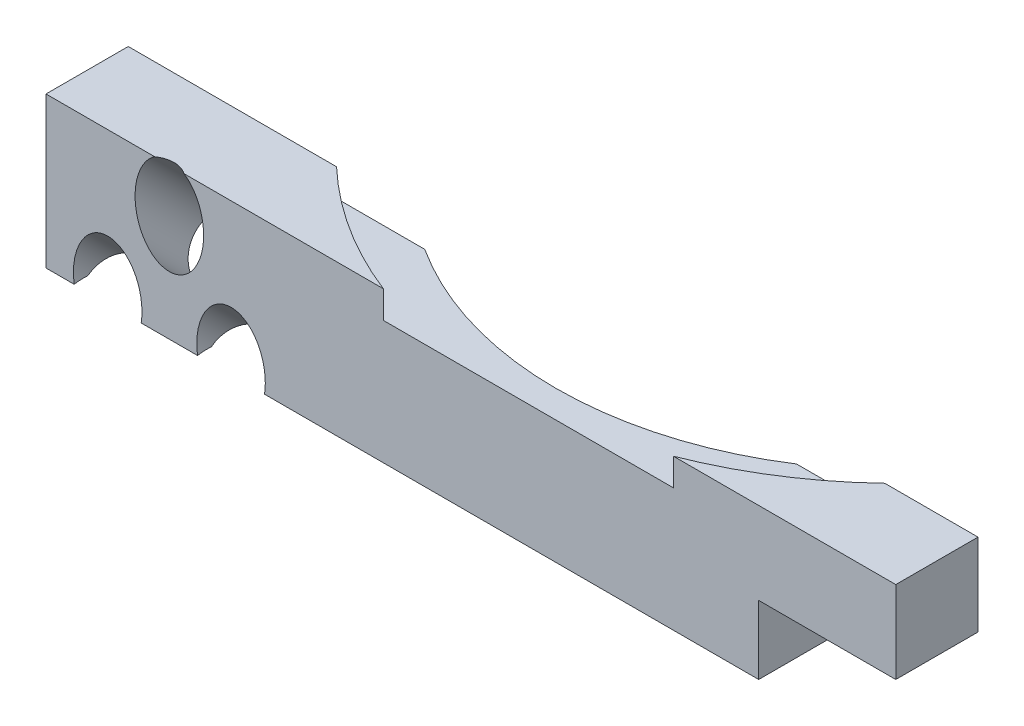
ISO-10303-21;
HEADER;
FILE_DESCRIPTION(('STEP AP214'),'2;1');
FILE_NAME('part.step','',(''),(''),'','','');
FILE_SCHEMA(('AUTOMOTIVE_DESIGN { 1 0 10303 214 1 1 1 1 }'));
ENDSEC;
DATA;
#1=APPLICATION_CONTEXT('core data for automotive mechanical design processes');
#2=APPLICATION_PROTOCOL_DEFINITION('international standard','automotive_design',2000,#1);
#3=PRODUCT_CONTEXT('',#1,'mechanical');
#4=PRODUCT('Part','Part','',(#3));
#5=PRODUCT_RELATED_PRODUCT_CATEGORY('part','',(#4));
#6=PRODUCT_DEFINITION_FORMATION('','',#4);
#7=PRODUCT_DEFINITION_CONTEXT('part definition',#1,'design');
#8=PRODUCT_DEFINITION('design','',#6,#7);
#9=PRODUCT_DEFINITION_SHAPE('','',#8);
#10=(LENGTH_UNIT() NAMED_UNIT(*) SI_UNIT(.MILLI.,.METRE.));
#11=(NAMED_UNIT(*) PLANE_ANGLE_UNIT() SI_UNIT($,.RADIAN.));
#12=(NAMED_UNIT(*) SI_UNIT($,.STERADIAN.) SOLID_ANGLE_UNIT());
#13=UNCERTAINTY_MEASURE_WITH_UNIT(LENGTH_MEASURE(1.E-05),#10,'distance_accuracy_value','');
#14=(GEOMETRIC_REPRESENTATION_CONTEXT(3) GLOBAL_UNCERTAINTY_ASSIGNED_CONTEXT((#13)) GLOBAL_UNIT_ASSIGNED_CONTEXT((#10,
#11,#12)) REPRESENTATION_CONTEXT('',''));
#15=CARTESIAN_POINT('',(0.,0.,0.));
#16=DIRECTION('',(0.,0.,1.));
#17=DIRECTION('',(1.,0.,0.));
#18=AXIS2_PLACEMENT_3D('',#15,#16,#17);
#19=CARTESIAN_POINT('',(-35.2,-5.5,6.));
#20=DIRECTION('',(0.,1.,0.));
#21=DIRECTION('',(0.,0.,1.));
#22=AXIS2_PLACEMENT_3D('',#19,#20,#21);
#23=PLANE('',#22);
#24=DIRECTION('',(-1.,0.,0.));
#25=VECTOR('',#24,1.);
#26=CARTESIAN_POINT('',(-18.2,-5.5,4.94974746830584));
#27=LINE('',#26,#25);
#28=CARTESIAN_POINT('',(-24.1901392508919,-5.5,4.94974746830584));
#29=VERTEX_POINT('',#28);
#30=CARTESIAN_POINT('',(-28.2098607491081,-5.5,4.94974746830584));
#31=VERTEX_POINT('',#30);
#32=EDGE_CURVE('E187',#29,#31,#27,.T.);
#33=ORIENTED_EDGE('',*,*,#32,.F.);
#34=CARTESIAN_POINT('',(-21.7,-5.5,5.26345596729061));
#35=DIRECTION('',(0.,1.,0.));
#36=DIRECTION('',(0.,0.,-1.));
#37=AXIS2_PLACEMENT_3D('',#34,#35,#36);
#38=ELLIPSE('',#37,3.53553390593273,2.5);
#39=CARTESIAN_POINT('',(-24.1451485525301,-5.5,6.));
#40=VERTEX_POINT('',#39);
#41=EDGE_CURVE('E45',#29,#40,#38,.T.);
#42=ORIENTED_EDGE('',*,*,#41,.T.);
#43=DIRECTION('',(1.,0.,0.));
#44=VECTOR('',#43,1.);
#45=CARTESIAN_POINT('',(-35.2,-5.5,6.));
#46=LINE('',#45,#44);
#47=CARTESIAN_POINT('',(-28.2548514474699,-5.5,6.));
#48=VERTEX_POINT('',#47);
#49=EDGE_CURVE('E223',#48,#40,#46,.T.);
#50=ORIENTED_EDGE('',*,*,#49,.F.);
#51=CARTESIAN_POINT('',(-30.7,-5.5,5.26345596729061));
#52=DIRECTION('',(0.,1.,0.));
#53=DIRECTION('',(0.,0.,-1.));
#54=AXIS2_PLACEMENT_3D('',#51,#52,#53);
#55=ELLIPSE('',#54,3.53553390593273,2.5);
#56=EDGE_CURVE('E238',#48,#31,#55,.T.);
#57=ORIENTED_EDGE('',*,*,#56,.T.);
#58=EDGE_LOOP('',(#33,#42,#50,#57));
#59=FACE_BOUND('',#58,.T.);
#60=ADVANCED_FACE('F31',(#59),#23,.F.);
#61=CARTESIAN_POINT('',(-33.1901392508919,-5.5,4.94974746830584));
#62=VERTEX_POINT('',#61);
#63=CARTESIAN_POINT('',(-35.2,-5.5,4.94974746830584));
#64=VERTEX_POINT('',#63);
#65=EDGE_CURVE('E189',#62,#64,#27,.T.);
#66=ORIENTED_EDGE('',*,*,#65,.F.);
#67=CARTESIAN_POINT('',(-33.1451485525301,-5.5,6.));
#68=VERTEX_POINT('',#67);
#69=EDGE_CURVE('E53',#62,#68,#55,.T.);
#70=ORIENTED_EDGE('',*,*,#69,.T.);
#71=CARTESIAN_POINT('',(-35.2,-5.5,6.));
#72=VERTEX_POINT('',#71);
#73=EDGE_CURVE('E219',#72,#68,#46,.T.);
#74=ORIENTED_EDGE('',*,*,#73,.F.);
#75=DIRECTION('',(0.,0.,-1.));
#76=VECTOR('',#75,1.);
#77=CARTESIAN_POINT('',(-35.2,-5.5,6.));
#78=LINE('',#77,#76);
#79=EDGE_CURVE('E222',#72,#64,#78,.T.);
#80=ORIENTED_EDGE('',*,*,#79,.T.);
#81=EDGE_LOOP('',(#66,#70,#74,#80));
#82=FACE_BOUND('',#81,.T.);
#83=ADVANCED_FACE('F324',(#82),#23,.F.);
#84=CARTESIAN_POINT('',(-19.2548514474699,-5.5,6.));
#85=VERTEX_POINT('',#84);
#86=CARTESIAN_POINT('',(16.8,-5.5,6.));
#87=VERTEX_POINT('',#86);
#88=EDGE_CURVE('E179',#85,#87,#46,.T.);
#89=ORIENTED_EDGE('',*,*,#88,.F.);
#90=CARTESIAN_POINT('',(-19.2098607491081,-5.5,4.94974746830584));
#91=VERTEX_POINT('',#90);
#92=EDGE_CURVE('E167',#85,#91,#38,.T.);
#93=ORIENTED_EDGE('',*,*,#92,.T.);
#94=CARTESIAN_POINT('',(-18.2,-5.5,4.94974746830584));
#95=VERTEX_POINT('',#94);
#96=EDGE_CURVE('E177',#95,#91,#27,.T.);
#97=ORIENTED_EDGE('',*,*,#96,.F.);
#98=DIRECTION('',(0.,0.,1.));
#99=VECTOR('',#98,1.);
#100=CARTESIAN_POINT('',(-18.2,-5.5,3.));
#101=LINE('',#100,#99);
#102=CARTESIAN_POINT('',(-18.2,-5.5,0.));
#103=VERTEX_POINT('',#102);
#104=EDGE_CURVE('E203',#103,#95,#101,.T.);
#105=ORIENTED_EDGE('',*,*,#104,.F.);
#106=DIRECTION('',(1.,0.,0.));
#107=VECTOR('',#106,1.);
#108=CARTESIAN_POINT('',(-35.2,-5.5,0.));
#109=LINE('',#108,#107);
#110=CARTESIAN_POINT('',(16.8,-5.5,0.));
#111=VERTEX_POINT('',#110);
#112=EDGE_CURVE('E229',#103,#111,#109,.T.);
#113=ORIENTED_EDGE('',*,*,#112,.T.);
#114=DIRECTION('',(0.,0.,-1.));
#115=VECTOR('',#114,1.);
#116=CARTESIAN_POINT('',(16.8,-5.5,6.));
#117=LINE('',#116,#115);
#118=EDGE_CURVE('E261',#87,#111,#117,.T.);
#119=ORIENTED_EDGE('',*,*,#118,.F.);
#120=EDGE_LOOP('',(#89,#93,#97,#105,#113,#119));
#121=FACE_BOUND('',#120,.T.);
#122=ADVANCED_FACE('F175',(#121),#23,.F.);
#123=CARTESIAN_POINT('',(35.2,5.5,0.));
#124=DIRECTION('',(0.,0.,-1.));
#125=DIRECTION('',(-1.,0.,0.));
#126=AXIS2_PLACEMENT_3D('',#123,#124,#125);
#127=PLANE('',#126);
#128=CARTESIAN_POINT('',(-26.2,-3.69238815542514,0.));
#129=DIRECTION('',(0.,0.,-1.));
#130=DIRECTION('',(0.,-1.,0.));
#131=AXIS2_PLACEMENT_3D('',#128,#129,#130);
#132=ELLIPSE('',#131,3.53553390593274,2.5);
#133=CARTESIAN_POINT('',(-27.3460767256342,-0.550252531694176,0.));
#134=VERTEX_POINT('',#133);
#135=CARTESIAN_POINT('',(-25.0539232743658,-0.550252531694175,0.));
#136=VERTEX_POINT('',#135);
#137=EDGE_CURVE('E255',#134,#136,#132,.T.);
#138=ORIENTED_EDGE('',*,*,#137,.F.);
#139=DIRECTION('',(-1.,0.,0.));
#140=VECTOR('',#139,1.);
#141=CARTESIAN_POINT('',(-18.2,-0.550252531694175,0.));
#142=LINE('',#141,#140);
#143=CARTESIAN_POINT('',(-35.2,-0.550252531694175,0.));
#144=VERTEX_POINT('',#143);
#145=EDGE_CURVE('E199',#134,#144,#142,.T.);
#146=ORIENTED_EDGE('',*,*,#145,.T.);
#147=DIRECTION('',(0.,-1.,0.));
#148=VECTOR('',#147,1.);
#149=CARTESIAN_POINT('',(-35.2,-5.5,0.));
#150=LINE('',#149,#148);
#151=CARTESIAN_POINT('',(-35.2,5.5,0.));
#152=VERTEX_POINT('',#151);
#153=EDGE_CURVE('E226',#152,#144,#150,.T.);
#154=ORIENTED_EDGE('',*,*,#153,.F.);
#155=DIRECTION('',(-1.,0.,0.));
#156=VECTOR('',#155,1.);
#157=CARTESIAN_POINT('',(-35.2,5.5,0.));
#158=LINE('',#157,#156);
#159=CARTESIAN_POINT('',(-20.,5.5,0.));
#160=VERTEX_POINT('',#159);
#161=EDGE_CURVE('E210',#160,#152,#158,.T.);
#162=ORIENTED_EDGE('',*,*,#161,.F.);
#163=DIRECTION('',(0.,1.,0.));
#164=VECTOR('',#163,1.);
#165=CARTESIAN_POINT('',(-20.,3.5,0.));
#166=LINE('',#165,#164);
#167=CARTESIAN_POINT('',(-20.,3.5,0.));
#168=VERTEX_POINT('',#167);
#169=EDGE_CURVE('E305',#168,#160,#166,.T.);
#170=ORIENTED_EDGE('',*,*,#169,.F.);
#171=DIRECTION('',(-1.,0.,0.));
#172=VECTOR('',#171,1.);
#173=CARTESIAN_POINT('',(-55.0982844399323,3.5,0.));
#174=LINE('',#173,#172);
#175=CARTESIAN_POINT('',(-13.5646599662505,3.5,0.));
#176=VERTEX_POINT('',#175);
#177=EDGE_CURVE('E297',#176,#168,#174,.T.);
#178=ORIENTED_EDGE('',*,*,#177,.F.);
#179=DIRECTION('',(0.,1.,0.));
#180=VECTOR('',#179,1.);
#181=CARTESIAN_POINT('',(-13.5646599662505,-0.999999999999999,0.));
#182=LINE('',#181,#180);
#183=CARTESIAN_POINT('',(-13.5646599662505,-0.999999999999999,0.));
#184=VERTEX_POINT('',#183);
#185=EDGE_CURVE('E206',#184,#176,#182,.T.);
#186=ORIENTED_EDGE('',*,*,#185,.F.);
#187=DIRECTION('',(-1.,0.,0.));
#188=VECTOR('',#187,1.);
#189=CARTESIAN_POINT('',(-55.0982844399323,-0.999999999999999,0.));
#190=LINE('',#189,#188);
#191=CARTESIAN_POINT('',(13.5646599662505,-0.999999999999999,0.));
#192=VERTEX_POINT('',#191);
#193=EDGE_CURVE('E186',#192,#184,#190,.T.);
#194=ORIENTED_EDGE('',*,*,#193,.F.);
#195=DIRECTION('',(0.,1.,0.));
#196=VECTOR('',#195,1.);
#197=CARTESIAN_POINT('',(13.5646599662505,-0.999999999999999,0.));
#198=LINE('',#197,#196);
#199=CARTESIAN_POINT('',(13.5646599662505,3.5,0.));
#200=VERTEX_POINT('',#199);
#201=EDGE_CURVE('E207',#192,#200,#198,.T.);
#202=ORIENTED_EDGE('',*,*,#201,.T.);
#203=DIRECTION('',(-1.,0.,0.));
#204=VECTOR('',#203,1.);
#205=CARTESIAN_POINT('',(-55.0982844399323,3.5,0.));
#206=LINE('',#205,#204);
#207=CARTESIAN_POINT('',(20.,3.5,0.));
#208=VERTEX_POINT('',#207);
#209=EDGE_CURVE('E292',#208,#200,#206,.T.);
#210=ORIENTED_EDGE('',*,*,#209,.F.);
#211=DIRECTION('',(0.,1.,0.));
#212=VECTOR('',#211,1.);
#213=CARTESIAN_POINT('',(20.,3.5,0.));
#214=LINE('',#213,#212);
#215=CARTESIAN_POINT('',(20.,5.5,0.));
#216=VERTEX_POINT('',#215);
#217=EDGE_CURVE('E307',#208,#216,#214,.T.);
#218=ORIENTED_EDGE('',*,*,#217,.T.);
#219=CARTESIAN_POINT('',(26.8,5.5,0.));
#220=VERTEX_POINT('',#219);
#221=EDGE_CURVE('E224',#220,#216,#158,.T.);
#222=ORIENTED_EDGE('',*,*,#221,.F.);
#223=DIRECTION('',(0.,-1.,0.));
#224=VECTOR('',#223,1.);
#225=CARTESIAN_POINT('',(26.8,5.5,0.));
#226=LINE('',#225,#224);
#227=CARTESIAN_POINT('',(26.8,-0.5,0.));
#228=VERTEX_POINT('',#227);
#229=EDGE_CURVE('E276',#220,#228,#226,.T.);
#230=ORIENTED_EDGE('',*,*,#229,.T.);
#231=DIRECTION('',(1.,0.,0.));
#232=VECTOR('',#231,1.);
#233=CARTESIAN_POINT('',(35.2,-0.5,0.));
#234=LINE('',#233,#232);
#235=CARTESIAN_POINT('',(16.8,-0.5,0.));
#236=VERTEX_POINT('',#235);
#237=EDGE_CURVE('E260',#236,#228,#234,.T.);
#238=ORIENTED_EDGE('',*,*,#237,.F.);
#239=DIRECTION('',(0.,1.,0.));
#240=VECTOR('',#239,1.);
#241=CARTESIAN_POINT('',(16.8,5.5,0.));
#242=LINE('',#241,#240);
#243=EDGE_CURVE('E273',#111,#236,#242,.T.);
#244=ORIENTED_EDGE('',*,*,#243,.F.);
#245=ORIENTED_EDGE('',*,*,#112,.F.);
#246=DIRECTION('',(0.,-1.,0.));
#247=VECTOR('',#246,1.);
#248=CARTESIAN_POINT('',(-18.2,-9.88744618690545,0.));
#249=LINE('',#248,#247);
#250=CARTESIAN_POINT('',(-18.2,-0.550252531694175,0.));
#251=VERTEX_POINT('',#250);
#252=EDGE_CURVE('E314',#251,#103,#249,.T.);
#253=ORIENTED_EDGE('',*,*,#252,.F.);
#254=EDGE_CURVE('E194',#251,#136,#142,.T.);
#255=ORIENTED_EDGE('',*,*,#254,.T.);
#256=EDGE_LOOP('',(#138,#146,#154,#162,#170,#178,#186,#194,#202,#210,#218,#222,#230,#238,#244,
#245,#253,#255));
#257=FACE_BOUND('',#256,.T.);
#258=ADVANCED_FACE('F331',(#257),#127,.T.);
#259=CARTESIAN_POINT('',(-35.2,5.5,6.));
#260=DIRECTION('',(0.,-1.,0.));
#261=DIRECTION('',(0.,0.,-1.));
#262=AXIS2_PLACEMENT_3D('',#259,#260,#261);
#263=PLANE('',#262);
#264=DIRECTION('',(0.,0.,1.));
#265=VECTOR('',#264,1.);
#266=CARTESIAN_POINT('',(26.8,5.5,0.));
#267=LINE('',#266,#265);
#268=CARTESIAN_POINT('',(26.8,5.5,6.));
#269=VERTEX_POINT('',#268);
#270=EDGE_CURVE('E277',#220,#269,#267,.T.);
#271=ORIENTED_EDGE('',*,*,#270,.F.);
#272=ORIENTED_EDGE('',*,*,#221,.T.);
#273=CARTESIAN_POINT('',(0.,5.5,-21.));
#274=DIRECTION('',(0.,1.,0.));
#275=DIRECTION('',(0.,0.,1.));
#276=AXIS2_PLACEMENT_3D('',#273,#274,#275);
#277=CIRCLE('',#276,29.);
#278=CARTESIAN_POINT('',(10.5830052442584,5.5,6.));
#279=VERTEX_POINT('',#278);
#280=EDGE_CURVE('E282',#279,#216,#277,.T.);
#281=ORIENTED_EDGE('',*,*,#280,.F.);
#282=DIRECTION('',(-1.,0.,0.));
#283=VECTOR('',#282,1.);
#284=CARTESIAN_POINT('',(-35.2,5.5,6.));
#285=LINE('',#284,#283);
#286=EDGE_CURVE('E213',#269,#279,#285,.T.);
#287=ORIENTED_EDGE('',*,*,#286,.F.);
#288=EDGE_LOOP('',(#271,#272,#281,#287));
#289=FACE_BOUND('',#288,.T.);
#290=ADVANCED_FACE('F33',(#289),#263,.F.);
#291=CARTESIAN_POINT('',(35.2,5.5,6.));
#292=DIRECTION('',(0.,0.,-1.));
#293=DIRECTION('',(-1.,0.,0.));
#294=AXIS2_PLACEMENT_3D('',#291,#292,#293);
#295=PLANE('',#294);
#296=ORIENTED_EDGE('',*,*,#49,.T.);
#297=CARTESIAN_POINT('',(-21.7,-4.7634559672906,6.));
#298=DIRECTION('',(0.,0.,-1.));
#299=DIRECTION('',(0.,-1.,0.));
#300=AXIS2_PLACEMENT_3D('',#297,#298,#299);
#301=ELLIPSE('',#300,3.53553390593274,2.5);
#302=EDGE_CURVE('E180',#40,#85,#301,.T.);
#303=ORIENTED_EDGE('',*,*,#302,.T.);
#304=ORIENTED_EDGE('',*,*,#88,.T.);
#305=DIRECTION('',(0.,1.,0.));
#306=VECTOR('',#305,1.);
#307=CARTESIAN_POINT('',(16.8,-5.5,6.));
#308=LINE('',#307,#306);
#309=CARTESIAN_POINT('',(16.8,-0.5,6.));
#310=VERTEX_POINT('',#309);
#311=EDGE_CURVE('E258',#87,#310,#308,.T.);
#312=ORIENTED_EDGE('',*,*,#311,.T.);
#313=DIRECTION('',(1.,0.,0.));
#314=VECTOR('',#313,1.);
#315=CARTESIAN_POINT('',(16.8,-0.5,6.));
#316=LINE('',#315,#314);
#317=CARTESIAN_POINT('',(26.8,-0.5,6.));
#318=VERTEX_POINT('',#317);
#319=EDGE_CURVE('E262',#310,#318,#316,.T.);
#320=ORIENTED_EDGE('',*,*,#319,.T.);
#321=DIRECTION('',(0.,-1.,0.));
#322=VECTOR('',#321,1.);
#323=CARTESIAN_POINT('',(26.8,5.5,6.));
#324=LINE('',#323,#322);
#325=EDGE_CURVE('E280',#269,#318,#324,.T.);
#326=ORIENTED_EDGE('',*,*,#325,.F.);
#327=ORIENTED_EDGE('',*,*,#286,.T.);
#328=DIRECTION('',(0.,1.,0.));
#329=VECTOR('',#328,1.);
#330=CARTESIAN_POINT('',(10.5830052442584,3.5,6.));
#331=LINE('',#330,#329);
#332=CARTESIAN_POINT('',(10.5830052442584,3.5,6.));
#333=VERTEX_POINT('',#332);
#334=EDGE_CURVE('E310',#333,#279,#331,.T.);
#335=ORIENTED_EDGE('',*,*,#334,.F.);
#336=DIRECTION('',(1.,0.,0.));
#337=VECTOR('',#336,1.);
#338=CARTESIAN_POINT('',(-55.0982844399323,3.5,6.));
#339=LINE('',#338,#337);
#340=CARTESIAN_POINT('',(-10.5830052442584,3.5,6.));
#341=VERTEX_POINT('',#340);
#342=EDGE_CURVE('E285',#341,#333,#339,.T.);
#343=ORIENTED_EDGE('',*,*,#342,.F.);
#344=DIRECTION('',(0.,1.,0.));
#345=VECTOR('',#344,1.);
#346=CARTESIAN_POINT('',(-10.5830052442584,3.5,6.));
#347=LINE('',#346,#345);
#348=CARTESIAN_POINT('',(-10.5830052442584,5.5,6.));
#349=VERTEX_POINT('',#348);
#350=EDGE_CURVE('E301',#341,#349,#347,.T.);
#351=ORIENTED_EDGE('',*,*,#350,.T.);
#352=CARTESIAN_POINT('',(-25.1256029911849,5.5,6.));
#353=VERTEX_POINT('',#352);
#354=EDGE_CURVE('E216',#349,#353,#285,.T.);
#355=ORIENTED_EDGE('',*,*,#354,.T.);
#356=CARTESIAN_POINT('',(-26.2,2.30761184457489,6.));
#357=DIRECTION('',(0.,0.,-1.));
#358=DIRECTION('',(0.,-1.,0.));
#359=AXIS2_PLACEMENT_3D('',#356,#357,#358);
#360=ELLIPSE('',#359,3.53553390593274,2.5);
#361=CARTESIAN_POINT('',(-27.2743970088151,5.5,6.));
#362=VERTEX_POINT('',#361);
#363=EDGE_CURVE('E252',#353,#362,#360,.T.);
#364=ORIENTED_EDGE('',*,*,#363,.T.);
#365=CARTESIAN_POINT('',(-35.2,5.5,6.));
#366=VERTEX_POINT('',#365);
#367=EDGE_CURVE('E217',#362,#366,#285,.T.);
#368=ORIENTED_EDGE('',*,*,#367,.T.);
#369=DIRECTION('',(0.,-1.,0.));
#370=VECTOR('',#369,1.);
#371=CARTESIAN_POINT('',(-35.2,-5.5,6.));
#372=LINE('',#371,#370);
#373=EDGE_CURVE('E215',#366,#72,#372,.T.);
#374=ORIENTED_EDGE('',*,*,#373,.T.);
#375=ORIENTED_EDGE('',*,*,#73,.T.);
#376=CARTESIAN_POINT('',(-30.7,-4.7634559672906,6.));
#377=DIRECTION('',(0.,0.,-1.));
#378=DIRECTION('',(0.,-1.,0.));
#379=AXIS2_PLACEMENT_3D('',#376,#377,#378);
#380=ELLIPSE('',#379,3.53553390593274,2.5);
#381=EDGE_CURVE('E243',#68,#48,#380,.T.);
#382=ORIENTED_EDGE('',*,*,#381,.T.);
#383=EDGE_LOOP('',(#296,#303,#304,#312,#320,#326,#327,#335,#343,#351,#355,#364,#368,#374,#375,#382));
#384=FACE_BOUND('',#383,.T.);
#385=ADVANCED_FACE('F326',(#384),#295,.F.);
#386=ORIENTED_EDGE('',*,*,#367,.F.);
#387=CARTESIAN_POINT('',(-26.2,5.5,9.1923881554251));
#388=DIRECTION('',(0.,-1.,0.));
#389=DIRECTION('',(0.,0.,-1.));
#390=AXIS2_PLACEMENT_3D('',#387,#388,#389);
#391=ELLIPSE('',#390,3.53553390593273,2.5);
#392=EDGE_CURVE('E249',#362,#353,#391,.T.);
#393=ORIENTED_EDGE('',*,*,#392,.T.);
#394=ORIENTED_EDGE('',*,*,#354,.F.);
#395=EDGE_CURVE('E289',#160,#349,#277,.T.);
#396=ORIENTED_EDGE('',*,*,#395,.F.);
#397=ORIENTED_EDGE('',*,*,#161,.T.);
#398=DIRECTION('',(0.,0.,-1.));
#399=VECTOR('',#398,1.);
#400=CARTESIAN_POINT('',(-35.2,5.5,6.));
#401=LINE('',#400,#399);
#402=EDGE_CURVE('E234',#366,#152,#401,.T.);
#403=ORIENTED_EDGE('',*,*,#402,.F.);
#404=EDGE_LOOP('',(#386,#393,#394,#396,#397,#403));
#405=FACE_BOUND('',#404,.T.);
#406=ADVANCED_FACE('F343',(#405),#263,.F.);
#407=CARTESIAN_POINT('',(0.,-0.999999999999999,-21.));
#408=DIRECTION('',(0.,1.,0.));
#409=DIRECTION('',(0.,0.,1.));
#410=AXIS2_PLACEMENT_3D('',#407,#408,#409);
#411=CYLINDRICAL_SURFACE('',#410,25.);
#412=CARTESIAN_POINT('',(0.,3.5,-21.));
#413=DIRECTION('',(0.,1.,0.));
#414=DIRECTION('',(0.,0.,1.));
#415=AXIS2_PLACEMENT_3D('',#412,#413,#414);
#416=CIRCLE('',#415,25.);
#417=EDGE_CURVE('E295',#200,#176,#416,.F.);
#418=ORIENTED_EDGE('',*,*,#417,.F.);
#419=ORIENTED_EDGE('',*,*,#201,.F.);
#420=CARTESIAN_POINT('',(0.,-0.999999999999999,-21.));
#421=DIRECTION('',(0.,1.,0.));
#422=DIRECTION('',(0.,0.,1.));
#423=AXIS2_PLACEMENT_3D('',#420,#421,#422);
#424=CIRCLE('',#423,25.);
#425=EDGE_CURVE('E190',#184,#192,#424,.T.);
#426=ORIENTED_EDGE('',*,*,#425,.F.);
#427=ORIENTED_EDGE('',*,*,#185,.T.);
#428=EDGE_LOOP('',(#418,#419,#426,#427));
#429=FACE_BOUND('',#428,.T.);
#430=ADVANCED_FACE('F345',(#429),#411,.F.);
#431=CARTESIAN_POINT('',(-35.2,-5.5,6.));
#432=DIRECTION('',(1.,0.,0.));
#433=DIRECTION('',(0.,0.,-1.));
#434=AXIS2_PLACEMENT_3D('',#431,#432,#433);
#435=PLANE('',#434);
#436=DIRECTION('',(0.,-0.707106781186546,0.707106781186549));
#437=VECTOR('',#436,1.);
#438=CARTESIAN_POINT('',(-35.2,-6.71884935929979,6.16859682760564));
#439=LINE('',#438,#437);
#440=EDGE_CURVE('E304',#144,#64,#439,.T.);
#441=ORIENTED_EDGE('',*,*,#440,.T.);
#442=ORIENTED_EDGE('',*,*,#79,.F.);
#443=ORIENTED_EDGE('',*,*,#373,.F.);
#444=ORIENTED_EDGE('',*,*,#402,.T.);
#445=ORIENTED_EDGE('',*,*,#153,.T.);
#446=EDGE_LOOP('',(#441,#442,#443,#444,#445));
#447=FACE_BOUND('',#446,.T.);
#448=ADVANCED_FACE('F318',(#447),#435,.F.);
#449=CARTESIAN_POINT('',(-55.0982844399323,-0.999999999999999,3.));
#450=DIRECTION('',(0.,1.,0.));
#451=DIRECTION('',(0.,0.,1.));
#452=AXIS2_PLACEMENT_3D('',#449,#450,#451);
#453=PLANE('',#452);
#454=ORIENTED_EDGE('',*,*,#193,.T.);
#455=ORIENTED_EDGE('',*,*,#425,.T.);
#456=EDGE_LOOP('',(#454,#455));
#457=FACE_BOUND('',#456,.T.);
#458=ADVANCED_FACE('F368',(#457),#453,.T.);
#459=CARTESIAN_POINT('',(-18.2,-6.71884935929979,6.16859682760564));
#460=DIRECTION('',(0.,-0.707106781186549,-0.707106781186546));
#461=DIRECTION('',(0.,0.707106781186546,-0.707106781186549));
#462=AXIS2_PLACEMENT_3D('',#459,#460,#461);
#463=PLANE('',#462);
#464=CARTESIAN_POINT('',(-21.7,-5.65685424949238,5.10660171779822));
#465=DIRECTION('',(0.,-0.707106781186549,-0.707106781186546));
#466=DIRECTION('',(0.,0.707106781186546,-0.707106781186549));
#467=AXIS2_PLACEMENT_3D('',#464,#465,#466);
#468=CIRCLE('',#467,2.5);
#469=EDGE_CURVE('E11',#29,#91,#468,.T.);
#470=ORIENTED_EDGE('',*,*,#469,.F.);
#471=ORIENTED_EDGE('',*,*,#32,.T.);
#472=CARTESIAN_POINT('',(-30.7,-5.65685424949238,5.10660171779822));
#473=DIRECTION('',(0.,-0.707106781186549,-0.707106781186546));
#474=DIRECTION('',(0.,0.707106781186546,-0.707106781186549));
#475=AXIS2_PLACEMENT_3D('',#472,#473,#474);
#476=CIRCLE('',#475,2.5);
#477=EDGE_CURVE('E39',#62,#31,#476,.T.);
#478=ORIENTED_EDGE('',*,*,#477,.F.);
#479=ORIENTED_EDGE('',*,*,#65,.T.);
#480=ORIENTED_EDGE('',*,*,#440,.F.);
#481=ORIENTED_EDGE('',*,*,#145,.F.);
#482=CARTESIAN_POINT('',(-26.2,-2.12132034355965,1.57106781186548));
#483=DIRECTION('',(0.,-0.707106781186549,-0.707106781186546));
#484=DIRECTION('',(0.,0.707106781186546,-0.707106781186549));
#485=AXIS2_PLACEMENT_3D('',#482,#483,#484);
#486=CIRCLE('',#485,2.5);
#487=EDGE_CURVE('E245',#136,#134,#486,.T.);
#488=ORIENTED_EDGE('',*,*,#487,.F.);
#489=ORIENTED_EDGE('',*,*,#254,.F.);
#490=DIRECTION('',(0.,-0.707106781186546,0.707106781186549));
#491=VECTOR('',#490,1.);
#492=CARTESIAN_POINT('',(-18.2,-6.71884935929979,6.16859682760564));
#493=LINE('',#492,#491);
#494=EDGE_CURVE('E184',#251,#95,#493,.T.);
#495=ORIENTED_EDGE('',*,*,#494,.T.);
#496=ORIENTED_EDGE('',*,*,#96,.T.);
#497=EDGE_LOOP('',(#470,#471,#478,#479,#480,#481,#488,#489,#495,#496));
#498=FACE_BOUND('',#497,.T.);
#499=ADVANCED_FACE('F182',(#498),#463,.T.);
#500=CARTESIAN_POINT('',(-18.2,-9.88744618690545,3.));
#501=DIRECTION('',(-1.,0.,0.));
#502=DIRECTION('',(0.,0.,1.));
#503=AXIS2_PLACEMENT_3D('',#500,#501,#502);
#504=PLANE('',#503);
#505=ORIENTED_EDGE('',*,*,#494,.F.);
#506=ORIENTED_EDGE('',*,*,#252,.T.);
#507=ORIENTED_EDGE('',*,*,#104,.T.);
#508=EDGE_LOOP('',(#505,#506,#507));
#509=FACE_BOUND('',#508,.T.);
#510=ADVANCED_FACE('F374',(#509),#504,.T.);
#511=CARTESIAN_POINT('',(0.,3.5,-21.));
#512=DIRECTION('',(0.,1.,0.));
#513=DIRECTION('',(0.,0.,1.));
#514=AXIS2_PLACEMENT_3D('',#511,#512,#513);
#515=CYLINDRICAL_SURFACE('',#514,29.);
#516=ORIENTED_EDGE('',*,*,#395,.T.);
#517=ORIENTED_EDGE('',*,*,#350,.F.);
#518=CARTESIAN_POINT('',(0.,3.5,-21.));
#519=DIRECTION('',(0.,1.,0.));
#520=DIRECTION('',(0.,0.,1.));
#521=AXIS2_PLACEMENT_3D('',#518,#519,#520);
#522=CIRCLE('',#521,29.);
#523=EDGE_CURVE('E293',#168,#341,#522,.T.);
#524=ORIENTED_EDGE('',*,*,#523,.F.);
#525=ORIENTED_EDGE('',*,*,#169,.T.);
#526=EDGE_LOOP('',(#516,#517,#524,#525));
#527=FACE_BOUND('',#526,.T.);
#528=ADVANCED_FACE('F377',(#527),#515,.F.);
#529=ORIENTED_EDGE('',*,*,#280,.T.);
#530=ORIENTED_EDGE('',*,*,#217,.F.);
#531=EDGE_CURVE('E288',#333,#208,#522,.T.);
#532=ORIENTED_EDGE('',*,*,#531,.F.);
#533=ORIENTED_EDGE('',*,*,#334,.T.);
#534=EDGE_LOOP('',(#529,#530,#532,#533));
#535=FACE_BOUND('',#534,.T.);
#536=ADVANCED_FACE('F381',(#535),#515,.F.);
#537=CARTESIAN_POINT('',(-55.0982844399323,3.5,3.));
#538=DIRECTION('',(0.,1.,0.));
#539=DIRECTION('',(0.,0.,1.));
#540=AXIS2_PLACEMENT_3D('',#537,#538,#539);
#541=PLANE('',#540);
#542=ORIENTED_EDGE('',*,*,#342,.T.);
#543=ORIENTED_EDGE('',*,*,#531,.T.);
#544=ORIENTED_EDGE('',*,*,#209,.T.);
#545=ORIENTED_EDGE('',*,*,#417,.T.);
#546=ORIENTED_EDGE('',*,*,#177,.T.);
#547=ORIENTED_EDGE('',*,*,#523,.T.);
#548=EDGE_LOOP('',(#542,#543,#544,#545,#546,#547));
#549=FACE_BOUND('',#548,.T.);
#550=ADVANCED_FACE('F383',(#549),#541,.T.);
#551=CARTESIAN_POINT('',(26.8,5.5,0.));
#552=DIRECTION('',(1.,0.,0.));
#553=DIRECTION('',(0.,0.,-1.));
#554=AXIS2_PLACEMENT_3D('',#551,#552,#553);
#555=PLANE('',#554);
#556=DIRECTION('',(0.,0.,-1.));
#557=VECTOR('',#556,1.);
#558=CARTESIAN_POINT('',(26.8,-0.5,6.));
#559=LINE('',#558,#557);
#560=EDGE_CURVE('E265',#318,#228,#559,.T.);
#561=ORIENTED_EDGE('',*,*,#560,.T.);
#562=ORIENTED_EDGE('',*,*,#229,.F.);
#563=ORIENTED_EDGE('',*,*,#270,.T.);
#564=ORIENTED_EDGE('',*,*,#325,.T.);
#565=EDGE_LOOP('',(#561,#562,#563,#564));
#566=FACE_BOUND('',#565,.T.);
#567=ADVANCED_FACE('F386',(#566),#555,.T.);
#568=CARTESIAN_POINT('',(16.8,-5.5,6.));
#569=DIRECTION('',(-1.,0.,0.));
#570=DIRECTION('',(0.,0.,1.));
#571=AXIS2_PLACEMENT_3D('',#568,#569,#570);
#572=PLANE('',#571);
#573=ORIENTED_EDGE('',*,*,#118,.T.);
#574=ORIENTED_EDGE('',*,*,#243,.T.);
#575=DIRECTION('',(0.,0.,-1.));
#576=VECTOR('',#575,1.);
#577=CARTESIAN_POINT('',(16.8,-0.5,6.));
#578=LINE('',#577,#576);
#579=EDGE_CURVE('E257',#310,#236,#578,.T.);
#580=ORIENTED_EDGE('',*,*,#579,.F.);
#581=ORIENTED_EDGE('',*,*,#311,.F.);
#582=EDGE_LOOP('',(#573,#574,#580,#581));
#583=FACE_BOUND('',#582,.T.);
#584=ADVANCED_FACE('F340',(#583),#572,.F.);
#585=CARTESIAN_POINT('',(16.8,-0.5,6.));
#586=DIRECTION('',(0.,1.,0.));
#587=DIRECTION('',(0.,0.,1.));
#588=AXIS2_PLACEMENT_3D('',#585,#586,#587);
#589=PLANE('',#588);
#590=ORIENTED_EDGE('',*,*,#579,.T.);
#591=ORIENTED_EDGE('',*,*,#237,.T.);
#592=ORIENTED_EDGE('',*,*,#560,.F.);
#593=ORIENTED_EDGE('',*,*,#319,.F.);
#594=EDGE_LOOP('',(#590,#591,#592,#593));
#595=FACE_BOUND('',#594,.T.);
#596=ADVANCED_FACE('F338',(#595),#589,.F.);
#597=CARTESIAN_POINT('',(-26.2,3.90380592228745,7.59619407771256));
#598=DIRECTION('',(0.,-0.707106781186549,-0.707106781186546));
#599=DIRECTION('',(0.,0.707106781186546,-0.707106781186549));
#600=AXIS2_PLACEMENT_3D('',#597,#598,#599);
#601=CYLINDRICAL_SURFACE('',#600,2.5);
#602=ORIENTED_EDGE('',*,*,#137,.T.);
#603=ORIENTED_EDGE('',*,*,#487,.T.);
#604=EDGE_LOOP('',(#602,#603));
#605=FACE_BOUND('',#604,.T.);
#606=ORIENTED_EDGE('',*,*,#392,.F.);
#607=ORIENTED_EDGE('',*,*,#363,.F.);
#608=EDGE_LOOP('',(#606,#607));
#609=FACE_BOUND('',#608,.T.);
#610=ADVANCED_FACE('F335',(#605,#609),#601,.F.);
#611=CARTESIAN_POINT('',(-30.7,0.36827201635472,11.1317279836453));
#612=DIRECTION('',(0.,-0.707106781186549,-0.707106781186546));
#613=DIRECTION('',(0.,0.707106781186546,-0.707106781186549));
#614=AXIS2_PLACEMENT_3D('',#611,#612,#613);
#615=CYLINDRICAL_SURFACE('',#614,2.5);
#616=ORIENTED_EDGE('',*,*,#477,.T.);
#617=ORIENTED_EDGE('',*,*,#56,.F.);
#618=ORIENTED_EDGE('',*,*,#381,.F.);
#619=ORIENTED_EDGE('',*,*,#69,.F.);
#620=EDGE_LOOP('',(#616,#617,#618,#619));
#621=FACE_BOUND('',#620,.T.);
#622=ADVANCED_FACE('F237',(#621),#615,.F.);
#623=CARTESIAN_POINT('',(-21.7,0.36827201635472,11.1317279836453));
#624=DIRECTION('',(0.,-0.707106781186549,-0.707106781186546));
#625=DIRECTION('',(0.,0.707106781186546,-0.707106781186549));
#626=AXIS2_PLACEMENT_3D('',#623,#624,#625);
#627=CYLINDRICAL_SURFACE('',#626,2.5);
#628=ORIENTED_EDGE('',*,*,#469,.T.);
#629=ORIENTED_EDGE('',*,*,#92,.F.);
#630=ORIENTED_EDGE('',*,*,#302,.F.);
#631=ORIENTED_EDGE('',*,*,#41,.F.);
#632=EDGE_LOOP('',(#628,#629,#630,#631));
#633=FACE_BOUND('',#632,.T.);
#634=ADVANCED_FACE('F166',(#633),#627,.F.);
#635=CLOSED_SHELL('',(#60,#83,#122,#258,#290,#385,#406,#430,#448,#458,#499,#510,#528,#536,#550,
#567,#584,#596,#610,#622,#634));
#636=MANIFOLD_SOLID_BREP('B2',#635);
#637=ADVANCED_BREP_SHAPE_REPRESENTATION('',(#18,#636),#14);
#638=SHAPE_DEFINITION_REPRESENTATION(#9,#637);
ENDSEC;
END-ISO-10303-21;
